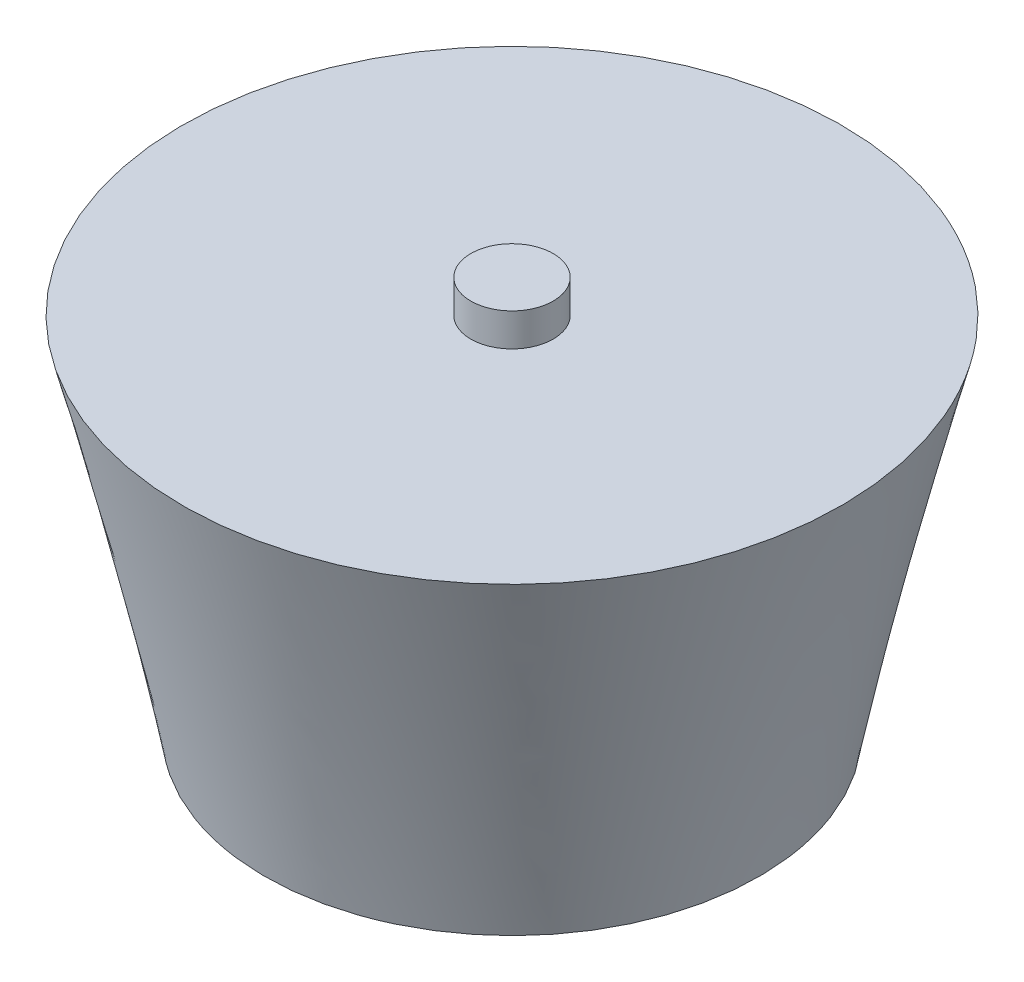
ISO-10303-21;
HEADER;
FILE_DESCRIPTION(('STEP AP214'),'2;1');
FILE_NAME('part.step','',(''),(''),'','','');
FILE_SCHEMA(('AUTOMOTIVE_DESIGN { 1 0 10303 214 1 1 1 1 }'));
ENDSEC;
DATA;
#1=APPLICATION_CONTEXT('core data for automotive mechanical design processes');
#2=APPLICATION_PROTOCOL_DEFINITION('international standard','automotive_design',2000,#1);
#3=PRODUCT_CONTEXT('',#1,'mechanical');
#4=PRODUCT('Part','Part','',(#3));
#5=PRODUCT_RELATED_PRODUCT_CATEGORY('part','',(#4));
#6=PRODUCT_DEFINITION_FORMATION('','',#4);
#7=PRODUCT_DEFINITION_CONTEXT('part definition',#1,'design');
#8=PRODUCT_DEFINITION('design','',#6,#7);
#9=PRODUCT_DEFINITION_SHAPE('','',#8);
#10=(LENGTH_UNIT() NAMED_UNIT(*) SI_UNIT(.MILLI.,.METRE.));
#11=(NAMED_UNIT(*) PLANE_ANGLE_UNIT() SI_UNIT($,.RADIAN.));
#12=(NAMED_UNIT(*) SI_UNIT($,.STERADIAN.) SOLID_ANGLE_UNIT());
#13=UNCERTAINTY_MEASURE_WITH_UNIT(LENGTH_MEASURE(1.E-05),#10,'distance_accuracy_value','');
#14=(GEOMETRIC_REPRESENTATION_CONTEXT(3) GLOBAL_UNCERTAINTY_ASSIGNED_CONTEXT((#13)) GLOBAL_UNIT_ASSIGNED_CONTEXT((#10,
#11,#12)) REPRESENTATION_CONTEXT('',''));
#15=CARTESIAN_POINT('',(0.,0.,0.));
#16=DIRECTION('',(0.,0.,1.));
#17=DIRECTION('',(1.,0.,0.));
#18=AXIS2_PLACEMENT_3D('',#15,#16,#17);
#19=CARTESIAN_POINT('',(0.,0.,0.));
#20=DIRECTION('',(0.,1.,0.));
#21=DIRECTION('',(0.,0.,1.));
#22=AXIS2_PLACEMENT_3D('',#19,#20,#21);
#23=PLANE('',#22);
#24=CARTESIAN_POINT('',(0.,0.,0.));
#25=DIRECTION('',(0.,1.,0.));
#26=DIRECTION('',(0.,0.,1.));
#27=AXIS2_PLACEMENT_3D('',#24,#25,#26);
#28=CIRCLE('',#27,15.);
#29=CARTESIAN_POINT('',(-6.75100904876697,0.,13.3949198139991));
#30=VERTEX_POINT('',#29);
#31=EDGE_CURVE('E11',#30,#30,#28,.T.);
#32=ORIENTED_EDGE('',*,*,#31,.F.);
#33=EDGE_LOOP('',(#32));
#34=FACE_BOUND('',#33,.T.);
#35=ADVANCED_FACE('F38',(#34),#23,.F.);
#36=CARTESIAN_POINT('',(0.,22.,0.));
#37=DIRECTION('',(0.,1.,0.));
#38=DIRECTION('',(0.,0.,1.));
#39=AXIS2_PLACEMENT_3D('',#36,#37,#38);
#40=PLANE('',#39);
#41=CARTESIAN_POINT('',(0.,22.,0.));
#42=DIRECTION('',(0.,1.,0.));
#43=DIRECTION('',(0.,0.,1.));
#44=AXIS2_PLACEMENT_3D('',#41,#42,#43);
#45=CIRCLE('',#44,2.5);
#46=CARTESIAN_POINT('',(0.,22.,2.5));
#47=VERTEX_POINT('',#46);
#48=EDGE_CURVE('E113',#47,#47,#45,.T.);
#49=ORIENTED_EDGE('',*,*,#48,.F.);
#50=EDGE_LOOP('',(#49));
#51=FACE_BOUND('',#50,.T.);
#52=CARTESIAN_POINT('',(0.,22.,0.));
#53=DIRECTION('',(0.,1.,0.));
#54=DIRECTION('',(0.,0.,1.));
#55=AXIS2_PLACEMENT_3D('',#52,#53,#54);
#56=CIRCLE('',#55,20.);
#57=CARTESIAN_POINT('',(-14.0082230156761,22.,14.2747920455284));
#58=VERTEX_POINT('',#57);
#59=EDGE_CURVE('E46',#58,#58,#56,.T.);
#60=ORIENTED_EDGE('',*,*,#59,.T.);
#61=EDGE_LOOP('',(#60));
#62=FACE_BOUND('',#61,.T.);
#63=ADVANCED_FACE('F71',(#51,#62),#40,.T.);
#64=CARTESIAN_POINT('',(-14.0082230156761,22.,14.2747920455284));
#65=CARTESIAN_POINT('',(-6.75100904876697,0.,13.3949198139991));
#66=CARTESIAN_POINT('',(-42.557807106733,22.,-13.7416539858238));
#67=CARTESIAN_POINT('',(-33.5408486767652,0.,-0.107098283534808));
#68=CARTESIAN_POINT('',(-14.5413610753807,22.,-42.2912380768807));
#69=CARTESIAN_POINT('',(-20.0388305792313,0.,-26.8969379115331));
#70=CARTESIAN_POINT('',(14.0082230156761,22.,-14.2747920455284));
#71=CARTESIAN_POINT('',(6.75100904876697,0.,-13.3949198139991));
#72=CARTESIAN_POINT('',(42.557807106733,22.,13.7416539858238));
#73=CARTESIAN_POINT('',(33.5408486767653,0.,0.107098283534817));
#74=CARTESIAN_POINT('',(14.5413610753807,22.,42.2912380768807));
#75=CARTESIAN_POINT('',(20.0388305792313,0.,26.8969379115331));
#76=CARTESIAN_POINT('',(-14.0082230156761,22.,14.2747920455284));
#77=CARTESIAN_POINT('',(-6.75100904876697,0.,13.3949198139991));
#78=(BOUNDED_SURFACE() B_SPLINE_SURFACE(3,1,((#64,#65),(#66,#67),(#68,#69),(#70,#71),(#72,#73),
(#74,#75),(#76,#77)),.UNSPECIFIED.,.T.,.F.,.F.) B_SPLINE_SURFACE_WITH_KNOTS((4,3,4),(2,2),(0.,
0.5,1.),(0.,1.),.UNSPECIFIED.) GEOMETRIC_REPRESENTATION_ITEM() RATIONAL_B_SPLINE_SURFACE(((1.,
1.),(0.333333333333333,0.333333333333333),(0.333333333333333,0.333333333333333),(1.,1.),
(0.333333333333333,0.333333333333333),(0.333333333333333,0.333333333333333),(1.,1.))) REPRESENTATION_ITEM('') SURFACE());
#79=CARTESIAN_POINT('',(-14.0082230156761,22.,14.2747920455284));
#80=CARTESIAN_POINT('',(-13.9326270368542,21.7708333333333,14.2656267097833));
#81=CARTESIAN_POINT('',(-13.8570310580322,21.5416666666667,14.2564613740382));
#82=CARTESIAN_POINT('',(-13.7058391003882,21.0833333333333,14.238130702548));
#83=CARTESIAN_POINT('',(-13.6302431215663,20.8541666666667,14.2289653668029));
#84=CARTESIAN_POINT('',(-13.4790511639223,20.3958333333333,14.2106346953128));
#85=CARTESIAN_POINT('',(-13.4034551851004,20.1666666666667,14.2014693595677));
#86=CARTESIAN_POINT('',(-13.2522632274564,19.7083333333333,14.1831386880775));
#87=CARTESIAN_POINT('',(-13.1766672486345,19.4791666666667,14.1739733523324));
#88=CARTESIAN_POINT('',(-13.0254752909905,19.0208333333333,14.1556426808422));
#89=CARTESIAN_POINT('',(-12.9498793121685,18.7916666666667,14.1464773450971));
#90=CARTESIAN_POINT('',(-12.7986873545246,18.3333333333333,14.1281466736069));
#91=CARTESIAN_POINT('',(-12.7230913757026,18.1041666666667,14.1189813378618));
#92=CARTESIAN_POINT('',(-12.5718994180587,17.6458333333333,14.1006506663716));
#93=CARTESIAN_POINT('',(-12.4963034392367,17.4166666666667,14.0914853306265));
#94=CARTESIAN_POINT('',(-12.3451114815928,16.9583333333333,14.0731546591363));
#95=CARTESIAN_POINT('',(-12.2695155027708,16.7291666666667,14.0639893233912));
#96=CARTESIAN_POINT('',(-12.1183235451269,16.2708333333333,14.045658651901));
#97=CARTESIAN_POINT('',(-12.0427275663049,16.0416666666667,14.0364933161559));
#98=CARTESIAN_POINT('',(-11.891535608661,15.5833333333333,14.0181626446657));
#99=CARTESIAN_POINT('',(-11.815939629839,15.3541666666667,14.0089973089206));
#100=CARTESIAN_POINT('',(-11.664747672195,14.8958333333333,13.9906666374304));
#101=CARTESIAN_POINT('',(-11.5891516933731,14.6666666666667,13.9815013016853));
#102=CARTESIAN_POINT('',(-11.4379597357291,14.2083333333333,13.9631706301951));
#103=CARTESIAN_POINT('',(-11.3623637569072,13.9791666666667,13.95400529445));
#104=CARTESIAN_POINT('',(-11.2111717992632,13.5208333333333,13.9356746229598));
#105=CARTESIAN_POINT('',(-11.1355758204413,13.2916666666667,13.9265092872147));
#106=CARTESIAN_POINT('',(-10.9843838627973,12.8333333333333,13.9081786157246));
#107=CARTESIAN_POINT('',(-10.9087878839753,12.6041666666667,13.8990132799795));
#108=CARTESIAN_POINT('',(-10.7575959263314,12.1458333333333,13.8806826084893));
#109=CARTESIAN_POINT('',(-10.6819999475094,11.9166666666667,13.8715172727442));
#110=CARTESIAN_POINT('',(-10.5308079898655,11.4583333333333,13.853186601254));
#111=CARTESIAN_POINT('',(-10.4552120110435,11.2291666666667,13.8440212655089));
#112=CARTESIAN_POINT('',(-10.3040200533996,10.7708333333333,13.8256905940187));
#113=CARTESIAN_POINT('',(-10.2284240745776,10.5416666666667,13.8165252582736));
#114=CARTESIAN_POINT('',(-10.0772321169337,10.0833333333333,13.7981945867834));
#115=CARTESIAN_POINT('',(-10.0016361381117,9.85416666666667,13.7890292510383));
#116=CARTESIAN_POINT('',(-9.85044418046776,9.39583333333333,13.7706985795481));
#117=CARTESIAN_POINT('',(-9.77484820164579,9.16666666666667,13.761533243803));
#118=CARTESIAN_POINT('',(-9.62365624400184,8.70833333333333,13.7432025723128));
#119=CARTESIAN_POINT('',(-9.54806026517987,8.47916666666667,13.7340372365677));
#120=CARTESIAN_POINT('',(-9.39686830753593,8.02083333333333,13.7157065650775));
#121=CARTESIAN_POINT('',(-9.32127232871396,7.79166666666667,13.7065412293324));
#122=CARTESIAN_POINT('',(-9.17008037107002,7.33333333333333,13.6882105578422));
#123=CARTESIAN_POINT('',(-9.09448439224805,7.10416666666667,13.6790452220971));
#124=CARTESIAN_POINT('',(-8.94329243460411,6.64583333333333,13.6607145506069));
#125=CARTESIAN_POINT('',(-8.86769645578214,6.41666666666667,13.6515492148618));
#126=CARTESIAN_POINT('',(-8.7165044981382,5.95833333333333,13.6332185433716));
#127=CARTESIAN_POINT('',(-8.64090851931623,5.72916666666667,13.6240532076266));
#128=CARTESIAN_POINT('',(-8.48971656167229,5.27083333333333,13.6057225361364));
#129=CARTESIAN_POINT('',(-8.41412058285032,5.04166666666667,13.5965572003913));
#130=CARTESIAN_POINT('',(-8.26292862520638,4.58333333333333,13.5782265289011));
#131=CARTESIAN_POINT('',(-8.18733264638441,4.35416666666667,13.569061193156));
#132=CARTESIAN_POINT('',(-8.03614068874047,3.89583333333333,13.5507305216658));
#133=CARTESIAN_POINT('',(-7.9605447099185,3.66666666666667,13.5415651859207));
#134=CARTESIAN_POINT('',(-7.80935275227456,3.20833333333333,13.5232345144305));
#135=CARTESIAN_POINT('',(-7.73375677345259,2.97916666666667,13.5140691786854));
#136=CARTESIAN_POINT('',(-7.58256481580864,2.52083333333333,13.4957385071952));
#137=CARTESIAN_POINT('',(-7.50696883698667,2.29166666666667,13.4865731714501));
#138=CARTESIAN_POINT('',(-7.35577687934273,1.83333333333333,13.4682424999599));
#139=CARTESIAN_POINT('',(-7.28018090052076,1.60416666666667,13.4590771642148));
#140=CARTESIAN_POINT('',(-7.12898894287682,1.14583333333333,13.4407464927246));
#141=CARTESIAN_POINT('',(-7.05339296405485,0.916666666666667,13.4315811569795));
#142=CARTESIAN_POINT('',(-6.90220100641091,0.458333333333333,13.4132504854893));
#143=CARTESIAN_POINT('',(-6.82660502758894,0.229166666666666,13.4040851497442));
#144=CARTESIAN_POINT('',(-6.75100904876697,0.,13.3949198139991));
#145=B_SPLINE_CURVE_WITH_KNOTS('',3,(#79,#80,#81,#82,#83,#84,#85,#86,#87,#88,#89,#90,#91,#92,
#93,#94,#95,#96,#97,#98,#99,#100,#101,#102,#103,#104,#105,#106,#107,#108,#109,#110,#111,#112,
#113,#114,#115,#116,#117,#118,#119,#120,#121,#122,#123,#124,#125,#126,#127,#128,#129,#130,#131,
#132,#133,#134,#135,#136,#137,#138,#139,#140,#141,#142,#143,#144),.UNSPECIFIED.,.F.,.F.,(4,2,2,
2,2,2,2,2,2,2,2,2,2,2,2,2,2,2,2,2,2,2,2,2,2,2,2,2,2,2,2,2,4),(0.,0.724461902752898,
1.4489238055058,2.17338570825869,2.89784761101159,3.62230951376449,4.34677141651739,
5.07123331927029,5.79569522202318,6.52015712477608,7.24461902752898,7.96908093028188,
8.69354283303477,9.41800473578767,10.1424666385406,10.8669285412935,11.5913904440464,
12.3158523467993,13.0403142495522,13.7647761523051,14.489238055058,15.2136999578109,
15.9381618605637,16.6626237633166,17.3870856660695,18.1115475688224,18.8360094715753,
19.5604713743282,20.2849332770811,21.009395179834,21.7338570825869,22.4583189853398,
23.1827808880927),.UNSPECIFIED.);
#146=EDGE_CURVE('BSEAM80',#58,#30,#145,.T.);
#147=ORIENTED_EDGE('',*,*,#59,.F.);
#148=ORIENTED_EDGE('',*,*,#31,.T.);
#149=ORIENTED_EDGE('',*,*,#146,.T.);
#150=ORIENTED_EDGE('',*,*,#146,.F.);
#151=EDGE_LOOP('',(#147,#149,#148,#150));
#152=FACE_BOUND('',#151,.T.);
#153=ADVANCED_FACE('F80',(#152),#78,.T.);
#154=CARTESIAN_POINT('',(0.,24.,0.));
#155=DIRECTION('',(0.,-1.,0.));
#156=DIRECTION('',(0.,0.,-1.));
#157=AXIS2_PLACEMENT_3D('',#154,#155,#156);
#158=CYLINDRICAL_SURFACE('',#157,2.5);
#159=CARTESIAN_POINT('',(0.,24.,0.));
#160=DIRECTION('',(0.,1.,0.));
#161=DIRECTION('',(0.,0.,1.));
#162=AXIS2_PLACEMENT_3D('',#159,#160,#161);
#163=CIRCLE('',#162,2.5);
#164=CARTESIAN_POINT('',(0.,24.,2.5));
#165=VERTEX_POINT('',#164);
#166=EDGE_CURVE('E51',#165,#165,#163,.T.);
#167=ORIENTED_EDGE('',*,*,#166,.F.);
#168=EDGE_LOOP('',(#167));
#169=FACE_BOUND('',#168,.T.);
#170=ORIENTED_EDGE('',*,*,#48,.T.);
#171=EDGE_LOOP('',(#170));
#172=FACE_BOUND('',#171,.T.);
#173=ADVANCED_FACE('F82',(#169,#172),#158,.T.);
#174=CARTESIAN_POINT('',(0.,24.,0.));
#175=DIRECTION('',(0.,1.,0.));
#176=DIRECTION('',(0.,0.,1.));
#177=AXIS2_PLACEMENT_3D('',#174,#175,#176);
#178=PLANE('',#177);
#179=ORIENTED_EDGE('',*,*,#166,.T.);
#180=EDGE_LOOP('',(#179));
#181=FACE_BOUND('',#180,.T.);
#182=ADVANCED_FACE('F119',(#181),#178,.T.);
#183=CLOSED_SHELL('',(#35,#63,#153,#173,#182));
#184=MANIFOLD_SOLID_BREP('B2',#183);
#185=ADVANCED_BREP_SHAPE_REPRESENTATION('',(#18,#184),#14);
#186=SHAPE_DEFINITION_REPRESENTATION(#9,#185);
ENDSEC;
END-ISO-10303-21;
